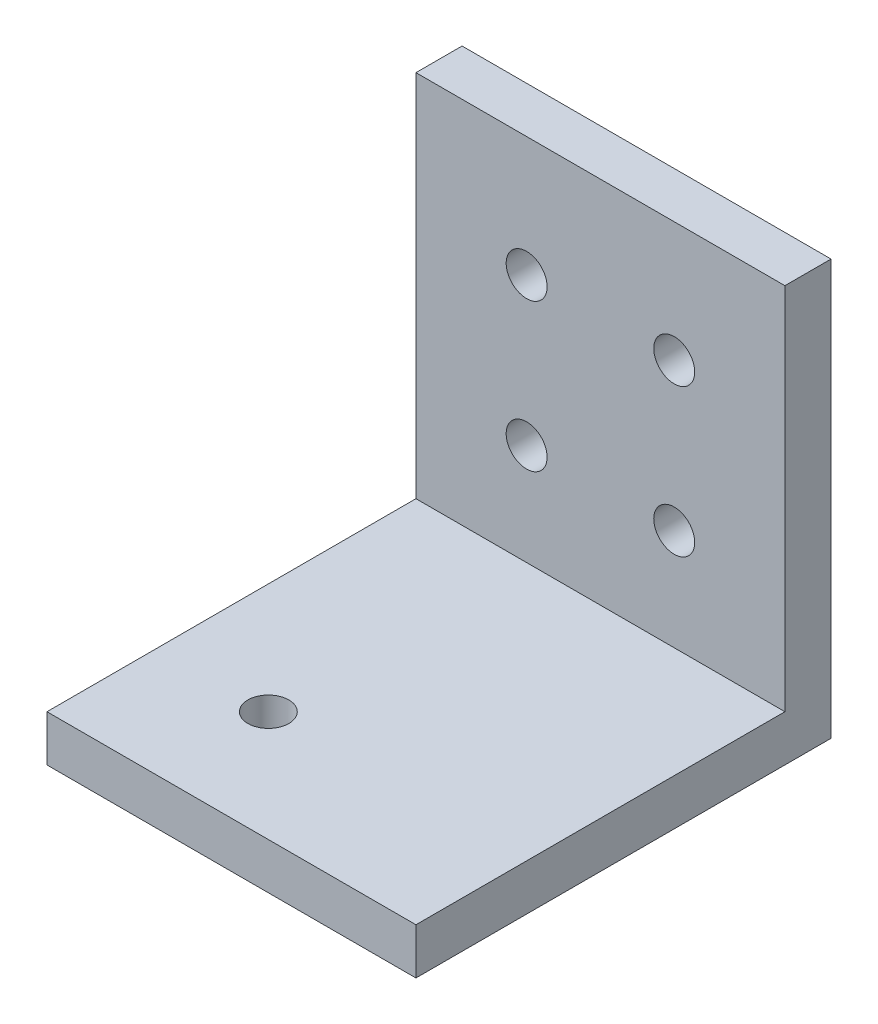
ISO-10303-21;
HEADER;
FILE_DESCRIPTION(('STEP AP214'),'2;1');
FILE_NAME('part.step','',(''),(''),'','','');
FILE_SCHEMA(('AUTOMOTIVE_DESIGN { 1 0 10303 214 1 1 1 1 }'));
ENDSEC;
DATA;
#1=APPLICATION_CONTEXT('core data for automotive mechanical design processes');
#2=APPLICATION_PROTOCOL_DEFINITION('international standard','automotive_design',2000,#1);
#3=PRODUCT_CONTEXT('',#1,'mechanical');
#4=PRODUCT('Part','Part','',(#3));
#5=PRODUCT_RELATED_PRODUCT_CATEGORY('part','',(#4));
#6=PRODUCT_DEFINITION_FORMATION('','',#4);
#7=PRODUCT_DEFINITION_CONTEXT('part definition',#1,'design');
#8=PRODUCT_DEFINITION('design','',#6,#7);
#9=PRODUCT_DEFINITION_SHAPE('','',#8);
#10=(LENGTH_UNIT() NAMED_UNIT(*) SI_UNIT(.MILLI.,.METRE.));
#11=(NAMED_UNIT(*) PLANE_ANGLE_UNIT() SI_UNIT($,.RADIAN.));
#12=(NAMED_UNIT(*) SI_UNIT($,.STERADIAN.) SOLID_ANGLE_UNIT());
#13=UNCERTAINTY_MEASURE_WITH_UNIT(LENGTH_MEASURE(1.E-05),#10,'distance_accuracy_value','');
#14=(GEOMETRIC_REPRESENTATION_CONTEXT(3) GLOBAL_UNCERTAINTY_ASSIGNED_CONTEXT((#13)) GLOBAL_UNIT_ASSIGNED_CONTEXT((#10,
#11,#12)) REPRESENTATION_CONTEXT('',''));
#15=CARTESIAN_POINT('',(0.,0.,0.));
#16=DIRECTION('',(0.,0.,1.));
#17=DIRECTION('',(1.,0.,0.));
#18=AXIS2_PLACEMENT_3D('',#15,#16,#17);
#19=CARTESIAN_POINT('',(-5.08000000000001,-4.12750000000002,28.575));
#20=DIRECTION('',(0.,0.,-1.));
#21=DIRECTION('',(-1.,0.,0.));
#22=AXIS2_PLACEMENT_3D('',#19,#20,#21);
#23=CYLINDRICAL_SURFACE('',#22,1.4097);
#24=CARTESIAN_POINT('',(-5.08000000000001,-4.12750000000002,3.175));
#25=DIRECTION('',(0.,0.,1.));
#26=DIRECTION('',(1.,0.,0.));
#27=AXIS2_PLACEMENT_3D('',#24,#25,#26);
#28=CIRCLE('',#27,1.4097);
#29=CARTESIAN_POINT('',(-3.67030000000001,-4.12750000000002,3.175));
#30=VERTEX_POINT('',#29);
#31=EDGE_CURVE('E46',#30,#30,#28,.T.);
#32=ORIENTED_EDGE('',*,*,#31,.T.);
#33=EDGE_LOOP('',(#32));
#34=FACE_BOUND('',#33,.T.);
#35=CARTESIAN_POINT('',(-5.08000000000001,-4.12750000000002,0.));
#36=DIRECTION('',(0.,0.,-1.));
#37=DIRECTION('',(-1.,0.,0.));
#38=AXIS2_PLACEMENT_3D('',#35,#36,#37);
#39=CIRCLE('',#38,1.4097);
#40=CARTESIAN_POINT('',(-6.48970000000001,-4.12750000000002,0.));
#41=VERTEX_POINT('',#40);
#42=EDGE_CURVE('E11',#41,#41,#39,.T.);
#43=ORIENTED_EDGE('',*,*,#42,.T.);
#44=EDGE_LOOP('',(#43));
#45=FACE_BOUND('',#44,.T.);
#46=ADVANCED_FACE('F38',(#34,#45),#23,.F.);
#47=CARTESIAN_POINT('',(-5.08000000000001,6.03249999999998,28.575));
#48=DIRECTION('',(0.,0.,-1.));
#49=DIRECTION('',(-1.,0.,0.));
#50=AXIS2_PLACEMENT_3D('',#47,#48,#49);
#51=CYLINDRICAL_SURFACE('',#50,1.4097);
#52=CARTESIAN_POINT('',(-5.08000000000001,6.03249999999998,3.175));
#53=DIRECTION('',(0.,0.,1.));
#54=DIRECTION('',(1.,0.,0.));
#55=AXIS2_PLACEMENT_3D('',#52,#53,#54);
#56=CIRCLE('',#55,1.4097);
#57=CARTESIAN_POINT('',(-3.67030000000001,6.03249999999998,3.175));
#58=VERTEX_POINT('',#57);
#59=EDGE_CURVE('E134',#58,#58,#56,.T.);
#60=ORIENTED_EDGE('',*,*,#59,.T.);
#61=EDGE_LOOP('',(#60));
#62=FACE_BOUND('',#61,.T.);
#63=CARTESIAN_POINT('',(-5.08000000000001,6.03249999999998,0.));
#64=DIRECTION('',(0.,0.,-1.));
#65=DIRECTION('',(-1.,0.,0.));
#66=AXIS2_PLACEMENT_3D('',#63,#64,#65);
#67=CIRCLE('',#66,1.4097);
#68=CARTESIAN_POINT('',(-6.48970000000001,6.03249999999998,0.));
#69=VERTEX_POINT('',#68);
#70=EDGE_CURVE('E138',#69,#69,#67,.T.);
#71=ORIENTED_EDGE('',*,*,#70,.T.);
#72=EDGE_LOOP('',(#71));
#73=FACE_BOUND('',#72,.T.);
#74=ADVANCED_FACE('F166',(#62,#73),#51,.F.);
#75=CARTESIAN_POINT('',(12.7,14.2875,3.175));
#76=DIRECTION('',(-1.,0.,0.));
#77=DIRECTION('',(0.,-1.,0.));
#78=AXIS2_PLACEMENT_3D('',#75,#76,#77);
#79=PLANE('',#78);
#80=DIRECTION('',(0.,1.,0.));
#81=VECTOR('',#80,1.);
#82=CARTESIAN_POINT('',(12.7,14.2875,0.));
#83=LINE('',#82,#81);
#84=CARTESIAN_POINT('',(12.7,-14.2875,0.));
#85=VERTEX_POINT('',#84);
#86=CARTESIAN_POINT('',(12.7,14.2875,0.));
#87=VERTEX_POINT('',#86);
#88=EDGE_CURVE('E100',#85,#87,#83,.T.);
#89=ORIENTED_EDGE('',*,*,#88,.T.);
#90=DIRECTION('',(0.,0.,-1.));
#91=VECTOR('',#90,1.);
#92=CARTESIAN_POINT('',(12.7,14.2875,3.175));
#93=LINE('',#92,#91);
#94=CARTESIAN_POINT('',(12.7,14.2875,3.175));
#95=VERTEX_POINT('',#94);
#96=EDGE_CURVE('E131',#95,#87,#93,.T.);
#97=ORIENTED_EDGE('',*,*,#96,.F.);
#98=DIRECTION('',(0.,1.,0.));
#99=VECTOR('',#98,1.);
#100=CARTESIAN_POINT('',(12.7,14.2875,3.175));
#101=LINE('',#100,#99);
#102=CARTESIAN_POINT('',(12.7,-11.1125,3.175));
#103=VERTEX_POINT('',#102);
#104=EDGE_CURVE('E92',#103,#95,#101,.T.);
#105=ORIENTED_EDGE('',*,*,#104,.F.);
#106=DIRECTION('',(0.,0.,-1.));
#107=VECTOR('',#106,1.);
#108=CARTESIAN_POINT('',(12.7,-11.1125,28.575));
#109=LINE('',#108,#107);
#110=CARTESIAN_POINT('',(12.7,-11.1125,28.575));
#111=VERTEX_POINT('',#110);
#112=EDGE_CURVE('E112',#111,#103,#109,.T.);
#113=ORIENTED_EDGE('',*,*,#112,.F.);
#114=DIRECTION('',(0.,1.,0.));
#115=VECTOR('',#114,1.);
#116=CARTESIAN_POINT('',(12.7,-14.2875,28.575));
#117=LINE('',#116,#115);
#118=CARTESIAN_POINT('',(12.7,-14.2875,28.575));
#119=VERTEX_POINT('',#118);
#120=EDGE_CURVE('E103',#119,#111,#117,.T.);
#121=ORIENTED_EDGE('',*,*,#120,.F.);
#122=DIRECTION('',(0.,0.,-1.));
#123=VECTOR('',#122,1.);
#124=CARTESIAN_POINT('',(12.7,-14.2875,3.175));
#125=LINE('',#124,#123);
#126=EDGE_CURVE('E84',#119,#85,#125,.T.);
#127=ORIENTED_EDGE('',*,*,#126,.T.);
#128=EDGE_LOOP('',(#89,#97,#105,#113,#121,#127));
#129=FACE_BOUND('',#128,.T.);
#130=ADVANCED_FACE('F98',(#129),#79,.F.);
#131=CARTESIAN_POINT('',(-12.7,14.2875,3.175));
#132=DIRECTION('',(0.,-1.,0.));
#133=DIRECTION('',(0.,0.,-1.));
#134=AXIS2_PLACEMENT_3D('',#131,#132,#133);
#135=PLANE('',#134);
#136=DIRECTION('',(-1.,0.,0.));
#137=VECTOR('',#136,1.);
#138=CARTESIAN_POINT('',(-12.7,14.2875,0.));
#139=LINE('',#138,#137);
#140=CARTESIAN_POINT('',(-12.7,14.2875,0.));
#141=VERTEX_POINT('',#140);
#142=EDGE_CURVE('E109',#87,#141,#139,.T.);
#143=ORIENTED_EDGE('',*,*,#142,.T.);
#144=DIRECTION('',(0.,0.,-1.));
#145=VECTOR('',#144,1.);
#146=CARTESIAN_POINT('',(-12.7,14.2875,3.175));
#147=LINE('',#146,#145);
#148=CARTESIAN_POINT('',(-12.7,14.2875,3.175));
#149=VERTEX_POINT('',#148);
#150=EDGE_CURVE('E127',#149,#141,#147,.T.);
#151=ORIENTED_EDGE('',*,*,#150,.F.);
#152=DIRECTION('',(-1.,0.,0.));
#153=VECTOR('',#152,1.);
#154=CARTESIAN_POINT('',(-12.7,14.2875,3.175));
#155=LINE('',#154,#153);
#156=EDGE_CURVE('E59',#95,#149,#155,.T.);
#157=ORIENTED_EDGE('',*,*,#156,.F.);
#158=ORIENTED_EDGE('',*,*,#96,.T.);
#159=EDGE_LOOP('',(#143,#151,#157,#158));
#160=FACE_BOUND('',#159,.T.);
#161=ADVANCED_FACE('F174',(#160),#135,.F.);
#162=CARTESIAN_POINT('',(-12.7,14.2875,3.175));
#163=DIRECTION('',(1.,0.,0.));
#164=DIRECTION('',(0.,1.,0.));
#165=AXIS2_PLACEMENT_3D('',#162,#163,#164);
#166=PLANE('',#165);
#167=DIRECTION('',(0.,-1.,0.));
#168=VECTOR('',#167,1.);
#169=CARTESIAN_POINT('',(-12.7,14.2875,0.));
#170=LINE('',#169,#168);
#171=CARTESIAN_POINT('',(-12.7,-14.2875,0.));
#172=VERTEX_POINT('',#171);
#173=EDGE_CURVE('E93',#141,#172,#170,.T.);
#174=ORIENTED_EDGE('',*,*,#173,.T.);
#175=DIRECTION('',(0.,0.,-1.));
#176=VECTOR('',#175,1.);
#177=CARTESIAN_POINT('',(-12.7,-14.2875,3.175));
#178=LINE('',#177,#176);
#179=CARTESIAN_POINT('',(-12.7,-14.2875,28.575));
#180=VERTEX_POINT('',#179);
#181=EDGE_CURVE('E87',#180,#172,#178,.T.);
#182=ORIENTED_EDGE('',*,*,#181,.F.);
#183=DIRECTION('',(0.,-1.,0.));
#184=VECTOR('',#183,1.);
#185=CARTESIAN_POINT('',(-12.7,-14.2875,28.575));
#186=LINE('',#185,#184);
#187=CARTESIAN_POINT('',(-12.7,-11.1125,28.575));
#188=VERTEX_POINT('',#187);
#189=EDGE_CURVE('E211',#188,#180,#186,.T.);
#190=ORIENTED_EDGE('',*,*,#189,.F.);
#191=DIRECTION('',(0.,0.,-1.));
#192=VECTOR('',#191,1.);
#193=CARTESIAN_POINT('',(-12.7,-11.1125,28.575));
#194=LINE('',#193,#192);
#195=CARTESIAN_POINT('',(-12.7,-11.1125,3.175));
#196=VERTEX_POINT('',#195);
#197=EDGE_CURVE('E118',#188,#196,#194,.T.);
#198=ORIENTED_EDGE('',*,*,#197,.T.);
#199=DIRECTION('',(0.,-1.,0.));
#200=VECTOR('',#199,1.);
#201=CARTESIAN_POINT('',(-12.7,14.2875,3.175));
#202=LINE('',#201,#200);
#203=EDGE_CURVE('E105',#149,#196,#202,.T.);
#204=ORIENTED_EDGE('',*,*,#203,.F.);
#205=ORIENTED_EDGE('',*,*,#150,.T.);
#206=EDGE_LOOP('',(#174,#182,#190,#198,#204,#205));
#207=FACE_BOUND('',#206,.T.);
#208=ADVANCED_FACE('F159',(#207),#166,.F.);
#209=CARTESIAN_POINT('',(-12.7,-14.2875,3.175));
#210=DIRECTION('',(0.,1.,0.));
#211=DIRECTION('',(0.,0.,1.));
#212=AXIS2_PLACEMENT_3D('',#209,#210,#211);
#213=PLANE('',#212);
#214=CARTESIAN_POINT('',(-5.08,-14.2875,20.955));
#215=DIRECTION('',(0.,1.,0.));
#216=DIRECTION('',(0.,0.,1.));
#217=AXIS2_PLACEMENT_3D('',#214,#215,#216);
#218=CIRCLE('',#217,1.4097);
#219=CARTESIAN_POINT('',(-5.08,-14.2875,22.3647));
#220=VERTEX_POINT('',#219);
#221=EDGE_CURVE('E258',#220,#220,#218,.T.);
#222=ORIENTED_EDGE('',*,*,#221,.T.);
#223=EDGE_LOOP('',(#222));
#224=FACE_BOUND('',#223,.T.);
#225=DIRECTION('',(1.,0.,0.));
#226=VECTOR('',#225,1.);
#227=CARTESIAN_POINT('',(-12.7,-14.2875,0.));
#228=LINE('',#227,#226);
#229=EDGE_CURVE('E79',#172,#85,#228,.T.);
#230=ORIENTED_EDGE('',*,*,#229,.T.);
#231=ORIENTED_EDGE('',*,*,#126,.F.);
#232=DIRECTION('',(1.,0.,0.));
#233=VECTOR('',#232,1.);
#234=CARTESIAN_POINT('',(-12.7,-14.2875,28.575));
#235=LINE('',#234,#233);
#236=EDGE_CURVE('E206',#180,#119,#235,.T.);
#237=ORIENTED_EDGE('',*,*,#236,.F.);
#238=ORIENTED_EDGE('',*,*,#181,.T.);
#239=EDGE_LOOP('',(#230,#231,#237,#238));
#240=FACE_BOUND('',#239,.T.);
#241=ADVANCED_FACE('F81',(#224,#240),#213,.F.);
#242=CARTESIAN_POINT('',(0.,0.,3.175));
#243=DIRECTION('',(0.,0.,1.));
#244=DIRECTION('',(1.,0.,0.));
#245=AXIS2_PLACEMENT_3D('',#242,#243,#244);
#246=PLANE('',#245);
#247=CARTESIAN_POINT('',(5.07999999999999,-4.12750000000002,3.175));
#248=DIRECTION('',(0.,0.,1.));
#249=DIRECTION('',(1.,0.,0.));
#250=AXIS2_PLACEMENT_3D('',#247,#248,#249);
#251=CIRCLE('',#250,1.4097);
#252=CARTESIAN_POINT('',(6.48969999999999,-4.12750000000002,3.175));
#253=VERTEX_POINT('',#252);
#254=EDGE_CURVE('E265',#253,#253,#251,.T.);
#255=ORIENTED_EDGE('',*,*,#254,.F.);
#256=EDGE_LOOP('',(#255));
#257=FACE_BOUND('',#256,.T.);
#258=CARTESIAN_POINT('',(5.07999999999999,6.03249999999998,3.175));
#259=DIRECTION('',(0.,0.,1.));
#260=DIRECTION('',(1.,0.,0.));
#261=AXIS2_PLACEMENT_3D('',#258,#259,#260);
#262=CIRCLE('',#261,1.4097);
#263=CARTESIAN_POINT('',(6.48969999999999,6.03249999999998,3.175));
#264=VERTEX_POINT('',#263);
#265=EDGE_CURVE('E212',#264,#264,#262,.T.);
#266=ORIENTED_EDGE('',*,*,#265,.F.);
#267=EDGE_LOOP('',(#266));
#268=FACE_BOUND('',#267,.T.);
#269=DIRECTION('',(-1.,0.,0.));
#270=VECTOR('',#269,1.);
#271=CARTESIAN_POINT('',(-12.7,-11.1125,3.175));
#272=LINE('',#271,#270);
#273=EDGE_CURVE('E53',#103,#196,#272,.T.);
#274=ORIENTED_EDGE('',*,*,#273,.F.);
#275=ORIENTED_EDGE('',*,*,#104,.T.);
#276=ORIENTED_EDGE('',*,*,#156,.T.);
#277=ORIENTED_EDGE('',*,*,#203,.T.);
#278=EDGE_LOOP('',(#274,#275,#276,#277));
#279=FACE_BOUND('',#278,.T.);
#280=ORIENTED_EDGE('',*,*,#59,.F.);
#281=EDGE_LOOP('',(#280));
#282=FACE_BOUND('',#281,.T.);
#283=ORIENTED_EDGE('',*,*,#31,.F.);
#284=EDGE_LOOP('',(#283));
#285=FACE_BOUND('',#284,.T.);
#286=ADVANCED_FACE('F147',(#257,#268,#279,#282,#285),#246,.T.);
#287=CARTESIAN_POINT('',(0.,0.,0.));
#288=DIRECTION('',(0.,0.,1.));
#289=DIRECTION('',(1.,0.,0.));
#290=AXIS2_PLACEMENT_3D('',#287,#288,#289);
#291=PLANE('',#290);
#292=CARTESIAN_POINT('',(5.07999999999999,-4.12750000000002,0.));
#293=DIRECTION('',(0.,0.,-1.));
#294=DIRECTION('',(-1.,0.,0.));
#295=AXIS2_PLACEMENT_3D('',#292,#293,#294);
#296=CIRCLE('',#295,1.4097);
#297=CARTESIAN_POINT('',(3.67029999999999,-4.12750000000002,0.));
#298=VERTEX_POINT('',#297);
#299=EDGE_CURVE('E230',#298,#298,#296,.T.);
#300=ORIENTED_EDGE('',*,*,#299,.F.);
#301=EDGE_LOOP('',(#300));
#302=FACE_BOUND('',#301,.T.);
#303=CARTESIAN_POINT('',(5.07999999999999,6.03249999999998,0.));
#304=DIRECTION('',(0.,0.,-1.));
#305=DIRECTION('',(-1.,0.,0.));
#306=AXIS2_PLACEMENT_3D('',#303,#304,#305);
#307=CIRCLE('',#306,1.4097);
#308=CARTESIAN_POINT('',(3.67029999999999,6.03249999999998,0.));
#309=VERTEX_POINT('',#308);
#310=EDGE_CURVE('E224',#309,#309,#307,.T.);
#311=ORIENTED_EDGE('',*,*,#310,.F.);
#312=EDGE_LOOP('',(#311));
#313=FACE_BOUND('',#312,.T.);
#314=ORIENTED_EDGE('',*,*,#88,.F.);
#315=ORIENTED_EDGE('',*,*,#229,.F.);
#316=ORIENTED_EDGE('',*,*,#173,.F.);
#317=ORIENTED_EDGE('',*,*,#142,.F.);
#318=EDGE_LOOP('',(#314,#315,#316,#317));
#319=FACE_BOUND('',#318,.T.);
#320=ORIENTED_EDGE('',*,*,#70,.F.);
#321=EDGE_LOOP('',(#320));
#322=FACE_BOUND('',#321,.T.);
#323=ORIENTED_EDGE('',*,*,#42,.F.);
#324=EDGE_LOOP('',(#323));
#325=FACE_BOUND('',#324,.T.);
#326=ADVANCED_FACE('F107',(#302,#313,#319,#322,#325),#291,.F.);
#327=CARTESIAN_POINT('',(-12.7,-11.1125,28.575));
#328=DIRECTION('',(0.,-1.,0.));
#329=DIRECTION('',(0.,0.,-1.));
#330=AXIS2_PLACEMENT_3D('',#327,#328,#329);
#331=PLANE('',#330);
#332=CARTESIAN_POINT('',(-5.08,-11.1125,20.955));
#333=DIRECTION('',(0.,1.,0.));
#334=DIRECTION('',(0.,0.,1.));
#335=AXIS2_PLACEMENT_3D('',#332,#333,#334);
#336=CIRCLE('',#335,1.4097);
#337=CARTESIAN_POINT('',(-5.08,-11.1125,22.3647));
#338=VERTEX_POINT('',#337);
#339=EDGE_CURVE('E261',#338,#338,#336,.T.);
#340=ORIENTED_EDGE('',*,*,#339,.F.);
#341=EDGE_LOOP('',(#340));
#342=FACE_BOUND('',#341,.T.);
#343=ORIENTED_EDGE('',*,*,#273,.T.);
#344=ORIENTED_EDGE('',*,*,#197,.F.);
#345=DIRECTION('',(-1.,0.,0.));
#346=VECTOR('',#345,1.);
#347=CARTESIAN_POINT('',(-12.7,-11.1125,28.575));
#348=LINE('',#347,#346);
#349=EDGE_CURVE('E197',#111,#188,#348,.T.);
#350=ORIENTED_EDGE('',*,*,#349,.F.);
#351=ORIENTED_EDGE('',*,*,#112,.T.);
#352=EDGE_LOOP('',(#343,#344,#350,#351));
#353=FACE_BOUND('',#352,.T.);
#354=ADVANCED_FACE('F155',(#342,#353),#331,.F.);
#355=CARTESIAN_POINT('',(0.,0.,28.575));
#356=DIRECTION('',(0.,0.,-1.));
#357=DIRECTION('',(-1.,0.,0.));
#358=AXIS2_PLACEMENT_3D('',#355,#356,#357);
#359=PLANE('',#358);
#360=ORIENTED_EDGE('',*,*,#189,.T.);
#361=ORIENTED_EDGE('',*,*,#236,.T.);
#362=ORIENTED_EDGE('',*,*,#120,.T.);
#363=ORIENTED_EDGE('',*,*,#349,.T.);
#364=EDGE_LOOP('',(#360,#361,#362,#363));
#365=FACE_BOUND('',#364,.T.);
#366=ADVANCED_FACE('F234',(#365),#359,.F.);
#367=CARTESIAN_POINT('',(5.07999999999999,6.03249999999998,28.575));
#368=DIRECTION('',(0.,0.,-1.));
#369=DIRECTION('',(-1.,0.,0.));
#370=AXIS2_PLACEMENT_3D('',#367,#368,#369);
#371=CYLINDRICAL_SURFACE('',#370,1.4097);
#372=ORIENTED_EDGE('',*,*,#265,.T.);
#373=EDGE_LOOP('',(#372));
#374=FACE_BOUND('',#373,.T.);
#375=ORIENTED_EDGE('',*,*,#310,.T.);
#376=EDGE_LOOP('',(#375));
#377=FACE_BOUND('',#376,.T.);
#378=ADVANCED_FACE('F236',(#374,#377),#371,.F.);
#379=CARTESIAN_POINT('',(5.07999999999999,-4.12750000000002,28.575));
#380=DIRECTION('',(0.,0.,-1.));
#381=DIRECTION('',(-1.,0.,0.));
#382=AXIS2_PLACEMENT_3D('',#379,#380,#381);
#383=CYLINDRICAL_SURFACE('',#382,1.4097);
#384=ORIENTED_EDGE('',*,*,#254,.T.);
#385=EDGE_LOOP('',(#384));
#386=FACE_BOUND('',#385,.T.);
#387=ORIENTED_EDGE('',*,*,#299,.T.);
#388=EDGE_LOOP('',(#387));
#389=FACE_BOUND('',#388,.T.);
#390=ADVANCED_FACE('F242',(#386,#389),#383,.F.);
#391=CARTESIAN_POINT('',(-5.08,-14.2875,20.955));
#392=DIRECTION('',(0.,1.,0.));
#393=DIRECTION('',(0.,0.,1.));
#394=AXIS2_PLACEMENT_3D('',#391,#392,#393);
#395=CYLINDRICAL_SURFACE('',#394,1.4097);
#396=ORIENTED_EDGE('',*,*,#221,.F.);
#397=EDGE_LOOP('',(#396));
#398=FACE_BOUND('',#397,.T.);
#399=ORIENTED_EDGE('',*,*,#339,.T.);
#400=EDGE_LOOP('',(#399));
#401=FACE_BOUND('',#400,.T.);
#402=ADVANCED_FACE('F249',(#398,#401),#395,.F.);
#403=CLOSED_SHELL('',(#46,#74,#130,#161,#208,#241,#286,#326,#354,#366,#378,#390,#402));
#404=MANIFOLD_SOLID_BREP('B2',#403);
#405=ADVANCED_BREP_SHAPE_REPRESENTATION('',(#18,#404),#14);
#406=SHAPE_DEFINITION_REPRESENTATION(#9,#405);
ENDSEC;
END-ISO-10303-21;
